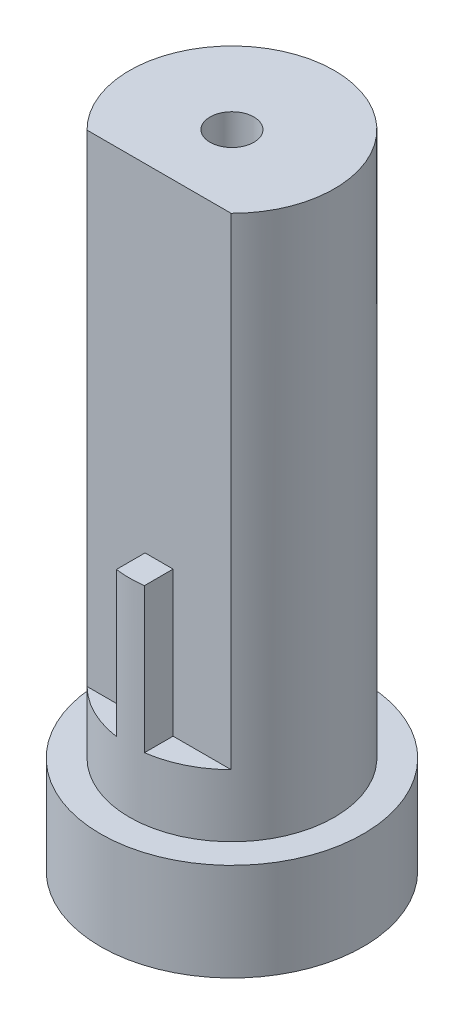
ISO-10303-21;
HEADER;
FILE_DESCRIPTION(('STEP AP214'),'2;1');
FILE_NAME('part.step','',(''),(''),'','','');
FILE_SCHEMA(('AUTOMOTIVE_DESIGN { 1 0 10303 214 1 1 1 1 }'));
ENDSEC;
DATA;
#1=APPLICATION_CONTEXT('core data for automotive mechanical design processes');
#2=APPLICATION_PROTOCOL_DEFINITION('international standard','automotive_design',2000,#1);
#3=PRODUCT_CONTEXT('',#1,'mechanical');
#4=PRODUCT('Part','Part','',(#3));
#5=PRODUCT_RELATED_PRODUCT_CATEGORY('part','',(#4));
#6=PRODUCT_DEFINITION_FORMATION('','',#4);
#7=PRODUCT_DEFINITION_CONTEXT('part definition',#1,'design');
#8=PRODUCT_DEFINITION('design','',#6,#7);
#9=PRODUCT_DEFINITION_SHAPE('','',#8);
#10=(LENGTH_UNIT() NAMED_UNIT(*) SI_UNIT(.MILLI.,.METRE.));
#11=(NAMED_UNIT(*) PLANE_ANGLE_UNIT() SI_UNIT($,.RADIAN.));
#12=(NAMED_UNIT(*) SI_UNIT($,.STERADIAN.) SOLID_ANGLE_UNIT());
#13=UNCERTAINTY_MEASURE_WITH_UNIT(LENGTH_MEASURE(1.E-05),#10,'distance_accuracy_value','');
#14=(GEOMETRIC_REPRESENTATION_CONTEXT(3) GLOBAL_UNCERTAINTY_ASSIGNED_CONTEXT((#13)) GLOBAL_UNIT_ASSIGNED_CONTEXT((#10,
#11,#12)) REPRESENTATION_CONTEXT('',''));
#15=CARTESIAN_POINT('',(0.,0.,0.));
#16=DIRECTION('',(0.,0.,1.));
#17=DIRECTION('',(1.,0.,0.));
#18=AXIS2_PLACEMENT_3D('',#15,#16,#17);
#19=CARTESIAN_POINT('',(0.,8.86,0.));
#20=DIRECTION('',(0.,1.,0.));
#21=DIRECTION('',(0.,0.,1.));
#22=AXIS2_PLACEMENT_3D('',#19,#20,#21);
#23=PLANE('',#22);
#24=DIRECTION('',(-1.,0.,0.));
#25=VECTOR('',#24,1.);
#26=CARTESIAN_POINT('',(0.,8.86,3.79));
#27=LINE('',#26,#25);
#28=CARTESIAN_POINT('',(4.33745316977601,8.86,3.79));
#29=VERTEX_POINT('',#28);
#30=CARTESIAN_POINT('',(-4.33745316977601,8.86,3.79));
#31=VERTEX_POINT('',#30);
#32=EDGE_CURVE('E119',#29,#31,#27,.T.);
#33=ORIENTED_EDGE('',*,*,#32,.F.);
#34=CARTESIAN_POINT('',(0.,8.86,0.));
#35=DIRECTION('',(0.,1.,0.));
#36=DIRECTION('',(0.,0.,1.));
#37=AXIS2_PLACEMENT_3D('',#34,#35,#36);
#38=CIRCLE('',#37,5.76);
#39=EDGE_CURVE('E124',#31,#29,#38,.T.);
#40=ORIENTED_EDGE('',*,*,#39,.F.);
#41=EDGE_LOOP('',(#33,#40));
#42=FACE_BOUND('',#41,.T.);
#43=ADVANCED_FACE('F38',(#42),#23,.F.);
#44=CARTESIAN_POINT('',(0.,44.,0.));
#45=DIRECTION('',(0.,-1.,0.));
#46=DIRECTION('',(0.,0.,-1.));
#47=AXIS2_PLACEMENT_3D('',#44,#45,#46);
#48=CYLINDRICAL_SURFACE('',#47,7.025);
#49=CARTESIAN_POINT('',(0.,6.69,0.));
#50=DIRECTION('',(0.,1.,0.));
#51=DIRECTION('',(0.,0.,1.));
#52=AXIS2_PLACEMENT_3D('',#49,#50,#51);
#53=CIRCLE('',#52,7.025);
#54=CARTESIAN_POINT('',(0.,6.69,7.025));
#55=VERTEX_POINT('',#54);
#56=EDGE_CURVE('E184',#55,#55,#53,.F.);
#57=ORIENTED_EDGE('',*,*,#56,.F.);
#58=EDGE_LOOP('',(#57));
#59=FACE_BOUND('',#58,.T.);
#60=CARTESIAN_POINT('',(0.,20.89,0.));
#61=DIRECTION('',(0.,1.,0.));
#62=DIRECTION('',(0.,0.,1.));
#63=AXIS2_PLACEMENT_3D('',#60,#61,#62);
#64=CIRCLE('',#63,7.025);
#65=CARTESIAN_POINT('',(-0.96,20.89,6.95909656492853));
#66=VERTEX_POINT('',#65);
#67=CARTESIAN_POINT('',(0.96,20.89,6.95909656492853));
#68=VERTEX_POINT('',#67);
#69=EDGE_CURVE('E138',#66,#68,#64,.T.);
#70=ORIENTED_EDGE('',*,*,#69,.F.);
#71=DIRECTION('',(0.,1.,0.));
#72=VECTOR('',#71,1.);
#73=CARTESIAN_POINT('',(-0.96,10.97,6.95909656492853));
#74=LINE('',#73,#72);
#75=CARTESIAN_POINT('',(-0.96,10.97,6.95909656492853));
#76=VERTEX_POINT('',#75);
#77=EDGE_CURVE('E154',#76,#66,#74,.T.);
#78=ORIENTED_EDGE('',*,*,#77,.F.);
#79=CARTESIAN_POINT('',(0.,10.97,0.));
#80=DIRECTION('',(0.,1.,0.));
#81=DIRECTION('',(0.,0.,1.));
#82=AXIS2_PLACEMENT_3D('',#79,#80,#81);
#83=CIRCLE('',#82,7.02500000000002);
#84=CARTESIAN_POINT('',(-4.9396963469428,10.97,4.995));
#85=VERTEX_POINT('',#84);
#86=EDGE_CURVE('E144',#85,#76,#83,.T.);
#87=ORIENTED_EDGE('',*,*,#86,.F.);
#88=DIRECTION('',(0.,1.,0.));
#89=VECTOR('',#88,1.);
#90=CARTESIAN_POINT('',(-4.9396963469428,10.97,4.995));
#91=LINE('',#90,#89);
#92=CARTESIAN_POINT('',(-4.9396963469428,44.,4.995));
#93=VERTEX_POINT('',#92);
#94=EDGE_CURVE('E157',#85,#93,#91,.T.);
#95=ORIENTED_EDGE('',*,*,#94,.T.);
#96=CARTESIAN_POINT('',(0.,44.,0.));
#97=DIRECTION('',(0.,1.,0.));
#98=DIRECTION('',(0.,0.,1.));
#99=AXIS2_PLACEMENT_3D('',#96,#97,#98);
#100=CIRCLE('',#99,7.025);
#101=CARTESIAN_POINT('',(4.9396963469428,44.,4.995));
#102=VERTEX_POINT('',#101);
#103=EDGE_CURVE('E160',#102,#93,#100,.T.);
#104=ORIENTED_EDGE('',*,*,#103,.F.);
#105=DIRECTION('',(0.,1.,0.));
#106=VECTOR('',#105,1.);
#107=CARTESIAN_POINT('',(4.9396963469428,10.97,4.995));
#108=LINE('',#107,#106);
#109=CARTESIAN_POINT('',(4.9396963469428,10.97,4.995));
#110=VERTEX_POINT('',#109);
#111=EDGE_CURVE('E174',#110,#102,#108,.T.);
#112=ORIENTED_EDGE('',*,*,#111,.F.);
#113=CARTESIAN_POINT('',(0.,10.97,0.));
#114=DIRECTION('',(0.,1.,0.));
#115=DIRECTION('',(0.,0.,1.));
#116=AXIS2_PLACEMENT_3D('',#113,#114,#115);
#117=CIRCLE('',#116,7.02500000000002);
#118=CARTESIAN_POINT('',(0.96,10.97,6.95909656492853));
#119=VERTEX_POINT('',#118);
#120=EDGE_CURVE('E143',#119,#110,#117,.T.);
#121=ORIENTED_EDGE('',*,*,#120,.F.);
#122=DIRECTION('',(0.,1.,0.));
#123=VECTOR('',#122,1.);
#124=CARTESIAN_POINT('',(0.96,10.97,6.95909656492853));
#125=LINE('',#124,#123);
#126=EDGE_CURVE('E156',#119,#68,#125,.T.);
#127=ORIENTED_EDGE('',*,*,#126,.T.);
#128=EDGE_LOOP('',(#70,#78,#87,#95,#104,#112,#121,#127));
#129=FACE_BOUND('',#128,.T.);
#130=ADVANCED_FACE('F226',(#59,#129),#48,.T.);
#131=CARTESIAN_POINT('',(0.96,10.97,4.995));
#132=DIRECTION('',(-1.,0.,0.));
#133=DIRECTION('',(0.,0.,1.));
#134=AXIS2_PLACEMENT_3D('',#131,#132,#133);
#135=PLANE('',#134);
#136=DIRECTION('',(0.,0.,-1.));
#137=VECTOR('',#136,1.);
#138=CARTESIAN_POINT('',(0.96,20.89,4.995));
#139=LINE('',#138,#137);
#140=CARTESIAN_POINT('',(0.96,20.89,4.995));
#141=VERTEX_POINT('',#140);
#142=EDGE_CURVE('E140',#68,#141,#139,.T.);
#143=ORIENTED_EDGE('',*,*,#142,.F.);
#144=ORIENTED_EDGE('',*,*,#126,.F.);
#145=DIRECTION('',(0.,0.,1.));
#146=VECTOR('',#145,1.);
#147=CARTESIAN_POINT('',(0.96,10.97,4.995));
#148=LINE('',#147,#146);
#149=CARTESIAN_POINT('',(0.96,10.97,4.995));
#150=VERTEX_POINT('',#149);
#151=EDGE_CURVE('E171',#150,#119,#148,.T.);
#152=ORIENTED_EDGE('',*,*,#151,.F.);
#153=DIRECTION('',(0.,1.,0.));
#154=VECTOR('',#153,1.);
#155=CARTESIAN_POINT('',(0.96,10.97,4.995));
#156=LINE('',#155,#154);
#157=EDGE_CURVE('E177',#150,#141,#156,.T.);
#158=ORIENTED_EDGE('',*,*,#157,.T.);
#159=EDGE_LOOP('',(#143,#144,#152,#158));
#160=FACE_BOUND('',#159,.T.);
#161=ADVANCED_FACE('F221',(#160),#135,.F.);
#162=CARTESIAN_POINT('',(-0.96,10.97,4.995));
#163=DIRECTION('',(1.,0.,0.));
#164=DIRECTION('',(0.,0.,-1.));
#165=AXIS2_PLACEMENT_3D('',#162,#163,#164);
#166=PLANE('',#165);
#167=DIRECTION('',(0.,0.,1.));
#168=VECTOR('',#167,1.);
#169=CARTESIAN_POINT('',(-0.96,20.89,4.995));
#170=LINE('',#169,#168);
#171=CARTESIAN_POINT('',(-0.96,20.89,4.995));
#172=VERTEX_POINT('',#171);
#173=EDGE_CURVE('E136',#172,#66,#170,.T.);
#174=ORIENTED_EDGE('',*,*,#173,.F.);
#175=DIRECTION('',(0.,1.,0.));
#176=VECTOR('',#175,1.);
#177=CARTESIAN_POINT('',(-0.96,10.97,4.995));
#178=LINE('',#177,#176);
#179=CARTESIAN_POINT('',(-0.96,10.97,4.995));
#180=VERTEX_POINT('',#179);
#181=EDGE_CURVE('E161',#180,#172,#178,.T.);
#182=ORIENTED_EDGE('',*,*,#181,.F.);
#183=DIRECTION('',(0.,0.,-1.));
#184=VECTOR('',#183,1.);
#185=CARTESIAN_POINT('',(-0.96,10.97,4.995));
#186=LINE('',#185,#184);
#187=EDGE_CURVE('E147',#76,#180,#186,.T.);
#188=ORIENTED_EDGE('',*,*,#187,.F.);
#189=ORIENTED_EDGE('',*,*,#77,.T.);
#190=EDGE_LOOP('',(#174,#182,#188,#189));
#191=FACE_BOUND('',#190,.T.);
#192=ADVANCED_FACE('F213',(#191),#166,.F.);
#193=CARTESIAN_POINT('',(0.,6.69,0.));
#194=DIRECTION('',(0.,-1.,0.));
#195=DIRECTION('',(0.,0.,-1.));
#196=AXIS2_PLACEMENT_3D('',#193,#194,#195);
#197=CYLINDRICAL_SURFACE('',#196,9.005);
#198=CARTESIAN_POINT('',(0.,6.69,0.));
#199=DIRECTION('',(0.,1.,0.));
#200=DIRECTION('',(0.,0.,1.));
#201=AXIS2_PLACEMENT_3D('',#198,#199,#200);
#202=CIRCLE('',#201,9.005);
#203=CARTESIAN_POINT('',(0.,6.69,9.005));
#204=VERTEX_POINT('',#203);
#205=EDGE_CURVE('E11',#204,#204,#202,.T.);
#206=ORIENTED_EDGE('',*,*,#205,.F.);
#207=EDGE_LOOP('',(#206));
#208=FACE_BOUND('',#207,.T.);
#209=CARTESIAN_POINT('',(0.,0.,0.));
#210=DIRECTION('',(0.,1.,0.));
#211=DIRECTION('',(0.,0.,1.));
#212=AXIS2_PLACEMENT_3D('',#209,#210,#211);
#213=CIRCLE('',#212,9.005);
#214=CARTESIAN_POINT('',(0.,0.,9.005));
#215=VERTEX_POINT('',#214);
#216=EDGE_CURVE('E47',#215,#215,#213,.T.);
#217=ORIENTED_EDGE('',*,*,#216,.T.);
#218=EDGE_LOOP('',(#217));
#219=FACE_BOUND('',#218,.T.);
#220=ADVANCED_FACE('F40',(#208,#219),#197,.T.);
#221=CARTESIAN_POINT('',(0.,6.69,0.));
#222=DIRECTION('',(0.,1.,0.));
#223=DIRECTION('',(0.,0.,1.));
#224=AXIS2_PLACEMENT_3D('',#221,#222,#223);
#225=PLANE('',#224);
#226=ORIENTED_EDGE('',*,*,#56,.T.);
#227=EDGE_LOOP('',(#226));
#228=FACE_BOUND('',#227,.T.);
#229=ORIENTED_EDGE('',*,*,#205,.T.);
#230=EDGE_LOOP('',(#229));
#231=FACE_BOUND('',#230,.T.);
#232=ADVANCED_FACE('F209',(#228,#231),#225,.T.);
#233=CARTESIAN_POINT('',(0.,0.,0.));
#234=DIRECTION('',(0.,1.,0.));
#235=DIRECTION('',(0.,0.,1.));
#236=AXIS2_PLACEMENT_3D('',#233,#234,#235);
#237=PLANE('',#236);
#238=CARTESIAN_POINT('',(0.,0.,0.));
#239=DIRECTION('',(0.,1.,0.));
#240=DIRECTION('',(0.,0.,1.));
#241=AXIS2_PLACEMENT_3D('',#238,#239,#240);
#242=CIRCLE('',#241,7.875);
#243=CARTESIAN_POINT('',(0.,0.,7.875));
#244=VERTEX_POINT('',#243);
#245=EDGE_CURVE('E131',#244,#244,#242,.T.);
#246=ORIENTED_EDGE('',*,*,#245,.T.);
#247=EDGE_LOOP('',(#246));
#248=FACE_BOUND('',#247,.T.);
#249=ORIENTED_EDGE('',*,*,#216,.F.);
#250=EDGE_LOOP('',(#249));
#251=FACE_BOUND('',#250,.T.);
#252=ADVANCED_FACE('F205',(#248,#251),#237,.F.);
#253=CARTESIAN_POINT('',(0.,44.,0.));
#254=DIRECTION('',(0.,1.,0.));
#255=DIRECTION('',(0.,0.,1.));
#256=AXIS2_PLACEMENT_3D('',#253,#254,#255);
#257=PLANE('',#256);
#258=CARTESIAN_POINT('',(0.,44.,0.));
#259=DIRECTION('',(0.,1.,0.));
#260=DIRECTION('',(0.,0.,1.));
#261=AXIS2_PLACEMENT_3D('',#258,#259,#260);
#262=CIRCLE('',#261,1.505);
#263=CARTESIAN_POINT('',(0.,44.,1.505));
#264=VERTEX_POINT('',#263);
#265=EDGE_CURVE('E130',#264,#264,#262,.T.);
#266=ORIENTED_EDGE('',*,*,#265,.F.);
#267=EDGE_LOOP('',(#266));
#268=FACE_BOUND('',#267,.T.);
#269=DIRECTION('',(-1.,0.,0.));
#270=VECTOR('',#269,1.);
#271=CARTESIAN_POINT('',(-4.9396963469428,44.,4.995));
#272=LINE('',#271,#270);
#273=EDGE_CURVE('E148',#102,#93,#272,.T.);
#274=ORIENTED_EDGE('',*,*,#273,.F.);
#275=ORIENTED_EDGE('',*,*,#103,.T.);
#276=EDGE_LOOP('',(#274,#275));
#277=FACE_BOUND('',#276,.T.);
#278=ADVANCED_FACE('F208',(#268,#277),#257,.T.);
#279=CARTESIAN_POINT('',(0.,10.97,0.));
#280=DIRECTION('',(0.,1.,0.));
#281=DIRECTION('',(0.,0.,1.));
#282=AXIS2_PLACEMENT_3D('',#279,#280,#281);
#283=PLANE('',#282);
#284=ORIENTED_EDGE('',*,*,#120,.T.);
#285=DIRECTION('',(-1.,0.,0.));
#286=VECTOR('',#285,1.);
#287=CARTESIAN_POINT('',(0.96,10.97,4.995));
#288=LINE('',#287,#286);
#289=EDGE_CURVE('E168',#110,#150,#288,.T.);
#290=ORIENTED_EDGE('',*,*,#289,.T.);
#291=ORIENTED_EDGE('',*,*,#151,.T.);
#292=EDGE_LOOP('',(#284,#290,#291));
#293=FACE_BOUND('',#292,.T.);
#294=ADVANCED_FACE('F251',(#293),#283,.T.);
#295=CARTESIAN_POINT('',(-4.9396963469428,10.97,4.995));
#296=DIRECTION('',(0.,0.,-1.));
#297=DIRECTION('',(-1.,0.,0.));
#298=AXIS2_PLACEMENT_3D('',#295,#296,#297);
#299=PLANE('',#298);
#300=ORIENTED_EDGE('',*,*,#273,.T.);
#301=ORIENTED_EDGE('',*,*,#94,.F.);
#302=DIRECTION('',(-1.,0.,0.));
#303=VECTOR('',#302,1.);
#304=CARTESIAN_POINT('',(-4.9396963469428,10.97,4.995));
#305=LINE('',#304,#303);
#306=EDGE_CURVE('E151',#180,#85,#305,.T.);
#307=ORIENTED_EDGE('',*,*,#306,.F.);
#308=ORIENTED_EDGE('',*,*,#181,.T.);
#309=DIRECTION('',(-1.,0.,0.));
#310=VECTOR('',#309,1.);
#311=CARTESIAN_POINT('',(-0.96,20.89,4.995));
#312=LINE('',#311,#310);
#313=EDGE_CURVE('E63',#141,#172,#312,.T.);
#314=ORIENTED_EDGE('',*,*,#313,.F.);
#315=ORIENTED_EDGE('',*,*,#157,.F.);
#316=ORIENTED_EDGE('',*,*,#289,.F.);
#317=ORIENTED_EDGE('',*,*,#111,.T.);
#318=EDGE_LOOP('',(#300,#301,#307,#308,#314,#315,#316,#317));
#319=FACE_BOUND('',#318,.T.);
#320=ADVANCED_FACE('F248',(#319),#299,.F.);
#321=CARTESIAN_POINT('',(0.,10.97,0.));
#322=DIRECTION('',(0.,1.,0.));
#323=DIRECTION('',(0.,0.,1.));
#324=AXIS2_PLACEMENT_3D('',#321,#322,#323);
#325=PLANE('',#324);
#326=ORIENTED_EDGE('',*,*,#86,.T.);
#327=ORIENTED_EDGE('',*,*,#187,.T.);
#328=ORIENTED_EDGE('',*,*,#306,.T.);
#329=EDGE_LOOP('',(#326,#327,#328));
#330=FACE_BOUND('',#329,.T.);
#331=ADVANCED_FACE('F245',(#330),#325,.T.);
#332=CARTESIAN_POINT('',(0.,20.89,0.));
#333=DIRECTION('',(0.,1.,0.));
#334=DIRECTION('',(0.,0.,1.));
#335=AXIS2_PLACEMENT_3D('',#332,#333,#334);
#336=PLANE('',#335);
#337=ORIENTED_EDGE('',*,*,#173,.T.);
#338=ORIENTED_EDGE('',*,*,#69,.T.);
#339=ORIENTED_EDGE('',*,*,#142,.T.);
#340=ORIENTED_EDGE('',*,*,#313,.T.);
#341=EDGE_LOOP('',(#337,#338,#339,#340));
#342=FACE_BOUND('',#341,.T.);
#343=ADVANCED_FACE('F241',(#342),#336,.T.);
#344=CARTESIAN_POINT('',(0.,0.,0.));
#345=DIRECTION('',(0.,1.,0.));
#346=DIRECTION('',(0.,0.,1.));
#347=AXIS2_PLACEMENT_3D('',#344,#345,#346);
#348=CYLINDRICAL_SURFACE('',#347,1.505);
#349=CARTESIAN_POINT('',(0.,40.88,0.));
#350=DIRECTION('',(0.,1.,0.));
#351=DIRECTION('',(0.,0.,1.));
#352=AXIS2_PLACEMENT_3D('',#349,#350,#351);
#353=CIRCLE('',#352,1.505);
#354=CARTESIAN_POINT('',(0.,40.88,1.505));
#355=VERTEX_POINT('',#354);
#356=EDGE_CURVE('E42',#355,#355,#353,.F.);
#357=ORIENTED_EDGE('',*,*,#356,.T.);
#358=EDGE_LOOP('',(#357));
#359=FACE_BOUND('',#358,.T.);
#360=ORIENTED_EDGE('',*,*,#265,.T.);
#361=EDGE_LOOP('',(#360));
#362=FACE_BOUND('',#361,.T.);
#363=ADVANCED_FACE('F196',(#359,#362),#348,.F.);
#364=CARTESIAN_POINT('',(0.,5.42,0.));
#365=DIRECTION('',(0.,1.,0.));
#366=DIRECTION('',(0.,0.,1.));
#367=AXIS2_PLACEMENT_3D('',#364,#365,#366);
#368=PLANE('',#367);
#369=CARTESIAN_POINT('',(0.,5.42,0.));
#370=DIRECTION('',(0.,1.,0.));
#371=DIRECTION('',(0.,0.,1.));
#372=AXIS2_PLACEMENT_3D('',#369,#370,#371);
#373=CIRCLE('',#372,5.76);
#374=CARTESIAN_POINT('',(0.,5.42,5.76));
#375=VERTEX_POINT('',#374);
#376=EDGE_CURVE('E126',#375,#375,#373,.F.);
#377=ORIENTED_EDGE('',*,*,#376,.F.);
#378=EDGE_LOOP('',(#377));
#379=FACE_BOUND('',#378,.T.);
#380=CARTESIAN_POINT('',(0.,5.42,0.));
#381=DIRECTION('',(0.,1.,0.));
#382=DIRECTION('',(0.,0.,1.));
#383=AXIS2_PLACEMENT_3D('',#380,#381,#382);
#384=CIRCLE('',#383,7.875);
#385=CARTESIAN_POINT('',(0.,5.42,7.875));
#386=VERTEX_POINT('',#385);
#387=EDGE_CURVE('E127',#386,#386,#384,.T.);
#388=ORIENTED_EDGE('',*,*,#387,.F.);
#389=EDGE_LOOP('',(#388));
#390=FACE_BOUND('',#389,.T.);
#391=ADVANCED_FACE('F192',(#379,#390),#368,.F.);
#392=CARTESIAN_POINT('',(0.,5.42,0.));
#393=DIRECTION('',(0.,-1.,0.));
#394=DIRECTION('',(0.,0.,-1.));
#395=AXIS2_PLACEMENT_3D('',#392,#393,#394);
#396=CYLINDRICAL_SURFACE('',#395,7.875);
#397=ORIENTED_EDGE('',*,*,#387,.T.);
#398=EDGE_LOOP('',(#397));
#399=FACE_BOUND('',#398,.T.);
#400=ORIENTED_EDGE('',*,*,#245,.F.);
#401=EDGE_LOOP('',(#400));
#402=FACE_BOUND('',#401,.T.);
#403=ADVANCED_FACE('F195',(#399,#402),#396,.F.);
#404=CARTESIAN_POINT('',(0.,8.86,0.));
#405=DIRECTION('',(0.,-1.,0.));
#406=DIRECTION('',(0.,0.,-1.));
#407=AXIS2_PLACEMENT_3D('',#404,#405,#406);
#408=CYLINDRICAL_SURFACE('',#407,5.76);
#409=ORIENTED_EDGE('',*,*,#376,.T.);
#410=EDGE_LOOP('',(#409));
#411=FACE_BOUND('',#410,.T.);
#412=ORIENTED_EDGE('',*,*,#39,.T.);
#413=DIRECTION('',(0.,-1.,0.));
#414=VECTOR('',#413,1.);
#415=CARTESIAN_POINT('',(4.33745316977601,40.88,3.79));
#416=LINE('',#415,#414);
#417=CARTESIAN_POINT('',(4.33745316977601,40.88,3.79));
#418=VERTEX_POINT('',#417);
#419=EDGE_CURVE('E55',#418,#29,#416,.T.);
#420=ORIENTED_EDGE('',*,*,#419,.F.);
#421=CARTESIAN_POINT('',(0.,40.88,0.));
#422=DIRECTION('',(0.,1.,0.));
#423=DIRECTION('',(0.,0.,1.));
#424=AXIS2_PLACEMENT_3D('',#421,#422,#423);
#425=CIRCLE('',#424,5.76);
#426=CARTESIAN_POINT('',(-4.33745316977601,40.88,3.79));
#427=VERTEX_POINT('',#426);
#428=EDGE_CURVE('E108',#418,#427,#425,.T.);
#429=ORIENTED_EDGE('',*,*,#428,.T.);
#430=DIRECTION('',(0.,-1.,0.));
#431=VECTOR('',#430,1.);
#432=CARTESIAN_POINT('',(-4.33745316977601,40.88,3.79));
#433=LINE('',#432,#431);
#434=EDGE_CURVE('E115',#427,#31,#433,.T.);
#435=ORIENTED_EDGE('',*,*,#434,.T.);
#436=EDGE_LOOP('',(#412,#420,#429,#435));
#437=FACE_BOUND('',#436,.T.);
#438=ADVANCED_FACE('F114',(#411,#437),#408,.F.);
#439=CARTESIAN_POINT('',(0.,40.88,0.));
#440=DIRECTION('',(0.,1.,0.));
#441=DIRECTION('',(0.,0.,1.));
#442=AXIS2_PLACEMENT_3D('',#439,#440,#441);
#443=PLANE('',#442);
#444=ORIENTED_EDGE('',*,*,#428,.F.);
#445=DIRECTION('',(1.,0.,0.));
#446=VECTOR('',#445,1.);
#447=CARTESIAN_POINT('',(4.33745316977601,40.88,3.79));
#448=LINE('',#447,#446);
#449=EDGE_CURVE('E104',#427,#418,#448,.T.);
#450=ORIENTED_EDGE('',*,*,#449,.F.);
#451=EDGE_LOOP('',(#444,#450));
#452=FACE_BOUND('',#451,.T.);
#453=ORIENTED_EDGE('',*,*,#356,.F.);
#454=EDGE_LOOP('',(#453));
#455=FACE_BOUND('',#454,.T.);
#456=ADVANCED_FACE('F106',(#452,#455),#443,.F.);
#457=CARTESIAN_POINT('',(4.33745316977601,40.88,3.79));
#458=DIRECTION('',(0.,0.,-1.));
#459=DIRECTION('',(-1.,0.,0.));
#460=AXIS2_PLACEMENT_3D('',#457,#458,#459);
#461=PLANE('',#460);
#462=ORIENTED_EDGE('',*,*,#32,.T.);
#463=ORIENTED_EDGE('',*,*,#434,.F.);
#464=ORIENTED_EDGE('',*,*,#449,.T.);
#465=ORIENTED_EDGE('',*,*,#419,.T.);
#466=EDGE_LOOP('',(#462,#463,#464,#465));
#467=FACE_BOUND('',#466,.T.);
#468=ADVANCED_FACE('F118',(#467),#461,.T.);
#469=CLOSED_SHELL('',(#43,#130,#161,#192,#220,#232,#252,#278,#294,#320,#331,#343,#363,#391,#403,
#438,#456,#468));
#470=MANIFOLD_SOLID_BREP('B2',#469);
#471=ADVANCED_BREP_SHAPE_REPRESENTATION('',(#18,#470),#14);
#472=SHAPE_DEFINITION_REPRESENTATION(#9,#471);
ENDSEC;
END-ISO-10303-21;
